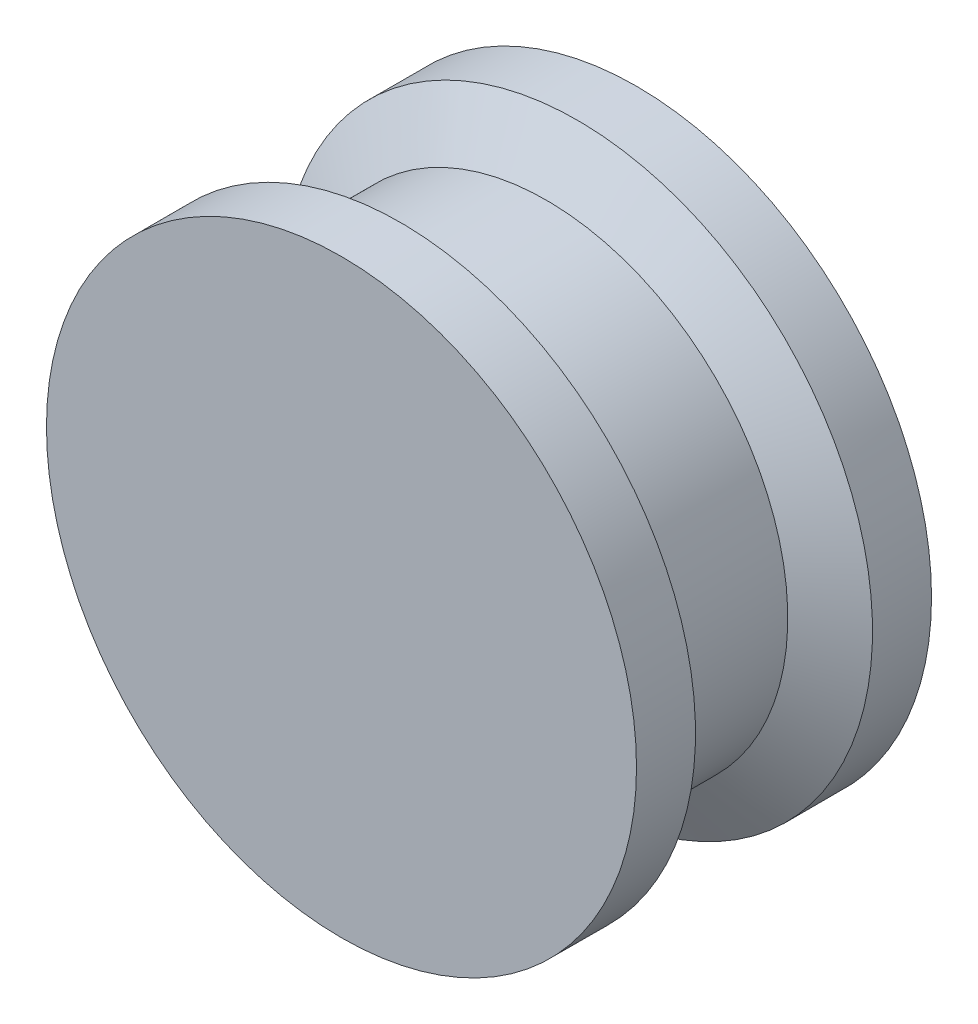
ISO-10303-21;
HEADER;
FILE_DESCRIPTION(('STEP AP214'),'2;1');
FILE_NAME('part.step','',(''),(''),'','','');
FILE_SCHEMA(('AUTOMOTIVE_DESIGN { 1 0 10303 214 1 1 1 1 }'));
ENDSEC;
DATA;
#1=APPLICATION_CONTEXT('core data for automotive mechanical design processes');
#2=APPLICATION_PROTOCOL_DEFINITION('international standard','automotive_design',2000,#1);
#3=PRODUCT_CONTEXT('',#1,'mechanical');
#4=PRODUCT('Part','Part','',(#3));
#5=PRODUCT_RELATED_PRODUCT_CATEGORY('part','',(#4));
#6=PRODUCT_DEFINITION_FORMATION('','',#4);
#7=PRODUCT_DEFINITION_CONTEXT('part definition',#1,'design');
#8=PRODUCT_DEFINITION('design','',#6,#7);
#9=PRODUCT_DEFINITION_SHAPE('','',#8);
#10=(LENGTH_UNIT() NAMED_UNIT(*) SI_UNIT(.MILLI.,.METRE.));
#11=(NAMED_UNIT(*) PLANE_ANGLE_UNIT() SI_UNIT($,.RADIAN.));
#12=(NAMED_UNIT(*) SI_UNIT($,.STERADIAN.) SOLID_ANGLE_UNIT());
#13=UNCERTAINTY_MEASURE_WITH_UNIT(LENGTH_MEASURE(1.E-05),#10,'distance_accuracy_value','');
#14=(GEOMETRIC_REPRESENTATION_CONTEXT(3) GLOBAL_UNCERTAINTY_ASSIGNED_CONTEXT((#13)) GLOBAL_UNIT_ASSIGNED_CONTEXT((#10,
#11,#12)) REPRESENTATION_CONTEXT('',''));
#15=CARTESIAN_POINT('',(0.,0.,0.));
#16=DIRECTION('',(0.,0.,1.));
#17=DIRECTION('',(1.,0.,0.));
#18=AXIS2_PLACEMENT_3D('',#15,#16,#17);
#19=CARTESIAN_POINT('',(0.,0.,5.));
#20=DIRECTION('',(0.,0.,-1.));
#21=DIRECTION('',(-1.,0.,0.));
#22=AXIS2_PLACEMENT_3D('',#19,#20,#21);
#23=CYLINDRICAL_SURFACE('',#22,10.);
#24=CARTESIAN_POINT('',(0.,0.,5.));
#25=DIRECTION('',(0.,0.,1.));
#26=DIRECTION('',(1.,0.,0.));
#27=AXIS2_PLACEMENT_3D('',#24,#25,#26);
#28=CIRCLE('',#27,10.);
#29=CARTESIAN_POINT('',(10.,0.,5.));
#30=VERTEX_POINT('',#29);
#31=EDGE_CURVE('E10',#30,#30,#28,.T.);
#32=ORIENTED_EDGE('',*,*,#31,.F.);
#33=EDGE_LOOP('',(#32));
#34=FACE_BOUND('',#33,.T.);
#35=CARTESIAN_POINT('',(0.,0.,3.));
#36=DIRECTION('',(0.,0.,-1.));
#37=DIRECTION('',(-1.,0.,0.));
#38=AXIS2_PLACEMENT_3D('',#35,#36,#37);
#39=CIRCLE('',#38,10.);
#40=CARTESIAN_POINT('',(-10.,0.,3.));
#41=VERTEX_POINT('',#40);
#42=EDGE_CURVE('E55',#41,#41,#39,.T.);
#43=ORIENTED_EDGE('',*,*,#42,.F.);
#44=EDGE_LOOP('',(#43));
#45=FACE_BOUND('',#44,.T.);
#46=ADVANCED_FACE('F43',(#34,#45),#23,.T.);
#47=CARTESIAN_POINT('',(0.,0.,5.));
#48=DIRECTION('',(0.,0.,1.));
#49=DIRECTION('',(1.,0.,0.));
#50=AXIS2_PLACEMENT_3D('',#47,#48,#49);
#51=PLANE('',#50);
#52=ORIENTED_EDGE('',*,*,#31,.T.);
#53=EDGE_LOOP('',(#52));
#54=FACE_BOUND('',#53,.T.);
#55=ADVANCED_FACE('F91',(#54),#51,.T.);
#56=CARTESIAN_POINT('',(0.,0.,1.94838575380667));
#57=DIRECTION('',(0.,0.,1.));
#58=DIRECTION('',(1.,0.,0.));
#59=AXIS2_PLACEMENT_3D('',#56,#57,#58);
#60=CONICAL_SURFACE('',#59,8.17855069562989,1.0471975511966);
#61=ORIENTED_EDGE('',*,*,#42,.T.);
#62=EDGE_LOOP('',(#61));
#63=FACE_BOUND('',#62,.T.);
#64=CARTESIAN_POINT('',(0.,0.,1.94838575380667));
#65=DIRECTION('',(0.,0.,-1.));
#66=DIRECTION('',(-1.,0.,0.));
#67=AXIS2_PLACEMENT_3D('',#64,#65,#66);
#68=CIRCLE('',#67,8.17855069562989);
#69=CARTESIAN_POINT('',(-8.17855069562989,0.,1.94838575380667));
#70=VERTEX_POINT('',#69);
#71=EDGE_CURVE('E60',#70,#70,#68,.T.);
#72=ORIENTED_EDGE('',*,*,#71,.F.);
#73=EDGE_LOOP('',(#72));
#74=FACE_BOUND('',#73,.T.);
#75=ADVANCED_FACE('F87',(#63,#74),#60,.T.);
#76=CARTESIAN_POINT('',(0.,0.,-6.38791657032026));
#77=DIRECTION('',(0.,0.,-1.));
#78=DIRECTION('',(-1.,0.,0.));
#79=AXIS2_PLACEMENT_3D('',#76,#77,#78);
#80=CYLINDRICAL_SURFACE('',#79,8.17855069562989);
#81=ORIENTED_EDGE('',*,*,#71,.T.);
#82=EDGE_LOOP('',(#81));
#83=FACE_BOUND('',#82,.T.);
#84=CARTESIAN_POINT('',(0.,0.,-1.94838575380667));
#85=DIRECTION('',(0.,0.,-1.));
#86=DIRECTION('',(-1.,0.,0.));
#87=AXIS2_PLACEMENT_3D('',#84,#85,#86);
#88=CIRCLE('',#87,8.17855069562989);
#89=CARTESIAN_POINT('',(-8.17855069562989,0.,-1.94838575380667));
#90=VERTEX_POINT('',#89);
#91=EDGE_CURVE('E64',#90,#90,#88,.T.);
#92=ORIENTED_EDGE('',*,*,#91,.F.);
#93=EDGE_LOOP('',(#92));
#94=FACE_BOUND('',#93,.T.);
#95=ADVANCED_FACE('F78',(#83,#94),#80,.T.);
#96=CARTESIAN_POINT('',(0.,0.,-3.));
#97=DIRECTION('',(0.,0.,-1.));
#98=DIRECTION('',(-1.,0.,0.));
#99=AXIS2_PLACEMENT_3D('',#96,#97,#98);
#100=CONICAL_SURFACE('',#99,10.,1.0471975511966);
#101=ORIENTED_EDGE('',*,*,#91,.T.);
#102=EDGE_LOOP('',(#101));
#103=FACE_BOUND('',#102,.T.);
#104=CARTESIAN_POINT('',(0.,0.,-3.));
#105=DIRECTION('',(0.,0.,-1.));
#106=DIRECTION('',(-1.,0.,0.));
#107=AXIS2_PLACEMENT_3D('',#104,#105,#106);
#108=CIRCLE('',#107,10.);
#109=CARTESIAN_POINT('',(-10.,0.,-3.));
#110=VERTEX_POINT('',#109);
#111=EDGE_CURVE('E68',#110,#110,#108,.T.);
#112=ORIENTED_EDGE('',*,*,#111,.F.);
#113=EDGE_LOOP('',(#112));
#114=FACE_BOUND('',#113,.T.);
#115=ADVANCED_FACE('F75',(#103,#114),#100,.T.);
#116=CARTESIAN_POINT('',(0.,0.,-5.));
#117=DIRECTION('',(0.,0.,1.));
#118=DIRECTION('',(1.,0.,0.));
#119=AXIS2_PLACEMENT_3D('',#116,#117,#118);
#120=PLANE('',#119);
#121=CARTESIAN_POINT('',(0.,0.,-5.));
#122=DIRECTION('',(0.,0.,1.));
#123=DIRECTION('',(1.,0.,0.));
#124=AXIS2_PLACEMENT_3D('',#121,#122,#123);
#125=CIRCLE('',#124,10.);
#126=CARTESIAN_POINT('',(10.,0.,-5.));
#127=VERTEX_POINT('',#126);
#128=EDGE_CURVE('E46',#127,#127,#125,.T.);
#129=ORIENTED_EDGE('',*,*,#128,.F.);
#130=EDGE_LOOP('',(#129));
#131=FACE_BOUND('',#130,.T.);
#132=ADVANCED_FACE('F77',(#131),#120,.F.);
#133=ORIENTED_EDGE('',*,*,#128,.T.);
#134=EDGE_LOOP('',(#133));
#135=FACE_BOUND('',#134,.T.);
#136=ORIENTED_EDGE('',*,*,#111,.T.);
#137=EDGE_LOOP('',(#136));
#138=FACE_BOUND('',#137,.T.);
#139=ADVANCED_FACE('F73',(#135,#138),#23,.T.);
#140=CLOSED_SHELL('',(#46,#55,#75,#95,#115,#132,#139));
#141=MANIFOLD_SOLID_BREP('B2',#140);
#142=ADVANCED_BREP_SHAPE_REPRESENTATION('',(#18,#141),#14);
#143=SHAPE_DEFINITION_REPRESENTATION(#9,#142);
ENDSEC;
END-ISO-10303-21;
